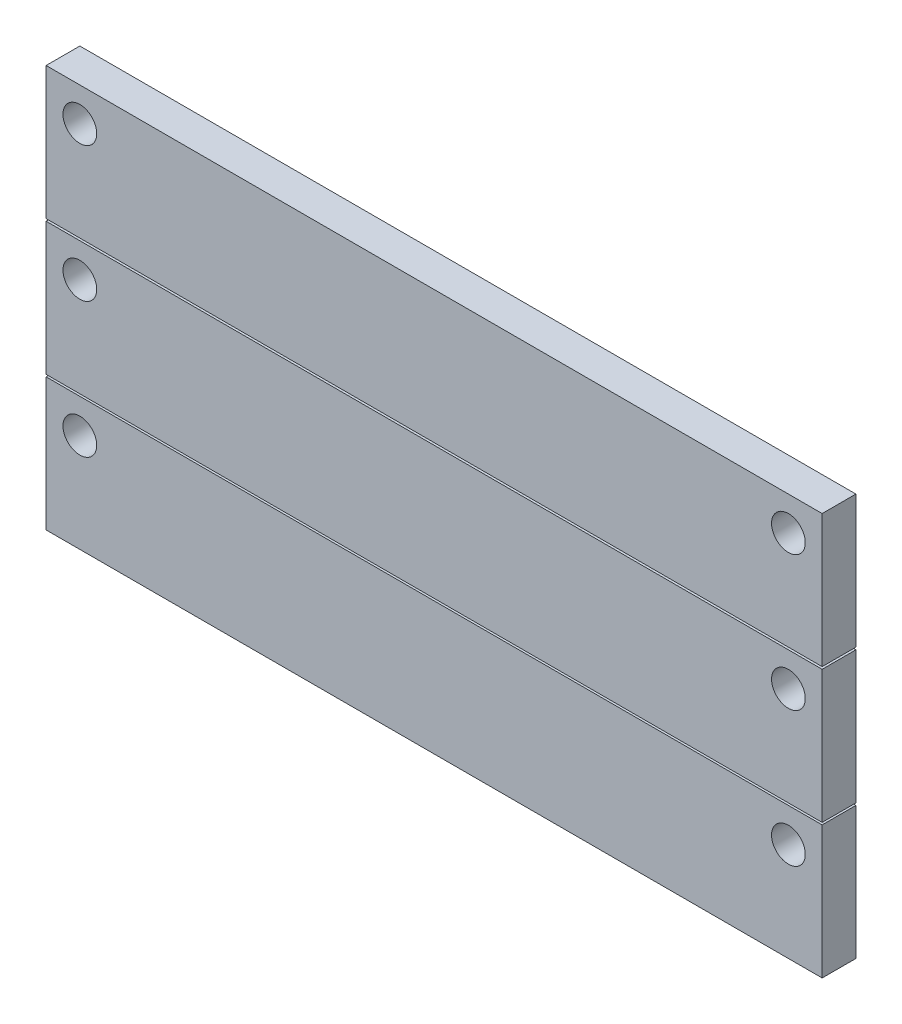
ISO-10303-21;
HEADER;
FILE_DESCRIPTION(('STEP AP214'),'2;1');
FILE_NAME('part.step','',(''),(''),'','','');
FILE_SCHEMA(('AUTOMOTIVE_DESIGN { 1 0 10303 214 1 1 1 1 }'));
ENDSEC;
DATA;
#1=APPLICATION_CONTEXT('core data for automotive mechanical design processes');
#2=APPLICATION_PROTOCOL_DEFINITION('international standard','automotive_design',2000,#1);
#3=PRODUCT_CONTEXT('',#1,'mechanical');
#4=PRODUCT('Part','Part','',(#3));
#5=PRODUCT_RELATED_PRODUCT_CATEGORY('part','',(#4));
#6=PRODUCT_DEFINITION_FORMATION('','',#4);
#7=PRODUCT_DEFINITION_CONTEXT('part definition',#1,'design');
#8=PRODUCT_DEFINITION('design','',#6,#7);
#9=PRODUCT_DEFINITION_SHAPE('','',#8);
#10=(LENGTH_UNIT() NAMED_UNIT(*) SI_UNIT(.MILLI.,.METRE.));
#11=(NAMED_UNIT(*) PLANE_ANGLE_UNIT() SI_UNIT($,.RADIAN.));
#12=(NAMED_UNIT(*) SI_UNIT($,.STERADIAN.) SOLID_ANGLE_UNIT());
#13=UNCERTAINTY_MEASURE_WITH_UNIT(LENGTH_MEASURE(1.E-05),#10,'distance_accuracy_value','');
#14=(GEOMETRIC_REPRESENTATION_CONTEXT(3) GLOBAL_UNCERTAINTY_ASSIGNED_CONTEXT((#13)) GLOBAL_UNIT_ASSIGNED_CONTEXT((#10,
#11,#12)) REPRESENTATION_CONTEXT('',''));
#15=CARTESIAN_POINT('',(0.,0.,0.));
#16=DIRECTION('',(0.,0.,1.));
#17=DIRECTION('',(1.,0.,0.));
#18=AXIS2_PLACEMENT_3D('',#15,#16,#17);
#19=CARTESIAN_POINT('',(0.,-201.267836193344,25.4));
#20=DIRECTION('',(0.,1.,0.));
#21=DIRECTION('',(0.,0.,1.));
#22=AXIS2_PLACEMENT_3D('',#19,#20,#21);
#23=PLANE('',#22);
#24=DIRECTION('',(1.,0.,0.));
#25=VECTOR('',#24,1.);
#26=CARTESIAN_POINT('',(0.,-201.267836193344,0.));
#27=LINE('',#26,#25);
#28=CARTESIAN_POINT('',(-584.2,-201.267836193344,0.));
#29=VERTEX_POINT('',#28);
#30=CARTESIAN_POINT('',(0.,-201.267836193344,0.));
#31=VERTEX_POINT('',#30);
#32=EDGE_CURVE('E114',#29,#31,#27,.T.);
#33=ORIENTED_EDGE('',*,*,#32,.T.);
#34=DIRECTION('',(0.,0.,-1.));
#35=VECTOR('',#34,1.);
#36=CARTESIAN_POINT('',(0.,-201.267836193344,25.4));
#37=LINE('',#36,#35);
#38=CARTESIAN_POINT('',(0.,-201.267836193344,25.4));
#39=VERTEX_POINT('',#38);
#40=EDGE_CURVE('E12',#39,#31,#37,.T.);
#41=ORIENTED_EDGE('',*,*,#40,.F.);
#42=DIRECTION('',(1.,0.,0.));
#43=VECTOR('',#42,1.);
#44=CARTESIAN_POINT('',(0.,-201.267836193344,25.4));
#45=LINE('',#44,#43);
#46=CARTESIAN_POINT('',(-584.2,-201.267836193344,25.4));
#47=VERTEX_POINT('',#46);
#48=EDGE_CURVE('E102',#47,#39,#45,.T.);
#49=ORIENTED_EDGE('',*,*,#48,.F.);
#50=DIRECTION('',(0.,0.,-1.));
#51=VECTOR('',#50,1.);
#52=CARTESIAN_POINT('',(-584.2,-201.267836193344,25.4));
#53=LINE('',#52,#51);
#54=EDGE_CURVE('E110',#47,#29,#53,.T.);
#55=ORIENTED_EDGE('',*,*,#54,.T.);
#56=EDGE_LOOP('',(#33,#41,#49,#55));
#57=FACE_BOUND('',#56,.T.);
#58=ADVANCED_FACE('F51',(#57),#23,.F.);
#59=CARTESIAN_POINT('',(0.,0.,25.4));
#60=DIRECTION('',(-1.,0.,0.));
#61=DIRECTION('',(0.,0.,1.));
#62=AXIS2_PLACEMENT_3D('',#59,#60,#61);
#63=PLANE('',#62);
#64=DIRECTION('',(0.,1.,0.));
#65=VECTOR('',#64,1.);
#66=CARTESIAN_POINT('',(0.,0.,0.));
#67=LINE('',#66,#65);
#68=CARTESIAN_POINT('',(0.,-101.445836193344,0.));
#69=VERTEX_POINT('',#68);
#70=EDGE_CURVE('E106',#31,#69,#67,.T.);
#71=ORIENTED_EDGE('',*,*,#70,.T.);
#72=DIRECTION('',(0.,0.,-1.));
#73=VECTOR('',#72,1.);
#74=CARTESIAN_POINT('',(0.,-101.445836193344,25.4));
#75=LINE('',#74,#73);
#76=CARTESIAN_POINT('',(0.,-101.445836193344,25.4));
#77=VERTEX_POINT('',#76);
#78=EDGE_CURVE('E59',#77,#69,#75,.T.);
#79=ORIENTED_EDGE('',*,*,#78,.F.);
#80=DIRECTION('',(0.,1.,0.));
#81=VECTOR('',#80,1.);
#82=CARTESIAN_POINT('',(0.,0.,25.4));
#83=LINE('',#82,#81);
#84=EDGE_CURVE('E97',#39,#77,#83,.T.);
#85=ORIENTED_EDGE('',*,*,#84,.F.);
#86=ORIENTED_EDGE('',*,*,#40,.T.);
#87=EDGE_LOOP('',(#71,#79,#85,#86));
#88=FACE_BOUND('',#87,.T.);
#89=ADVANCED_FACE('F105',(#88),#63,.F.);
#90=CARTESIAN_POINT('',(0.,-101.445836193344,25.4));
#91=DIRECTION('',(0.,-1.,0.));
#92=DIRECTION('',(1.,0.,0.));
#93=AXIS2_PLACEMENT_3D('',#90,#91,#92);
#94=PLANE('',#93);
#95=DIRECTION('',(-1.,0.,0.));
#96=VECTOR('',#95,1.);
#97=CARTESIAN_POINT('',(0.,-101.445836193344,0.));
#98=LINE('',#97,#96);
#99=CARTESIAN_POINT('',(-584.2,-101.445836193344,0.));
#100=VERTEX_POINT('',#99);
#101=EDGE_CURVE('E84',#69,#100,#98,.T.);
#102=ORIENTED_EDGE('',*,*,#101,.T.);
#103=DIRECTION('',(0.,0.,-1.));
#104=VECTOR('',#103,1.);
#105=CARTESIAN_POINT('',(-584.2,-101.445836193344,25.4));
#106=LINE('',#105,#104);
#107=CARTESIAN_POINT('',(-584.2,-101.445836193344,25.4));
#108=VERTEX_POINT('',#107);
#109=EDGE_CURVE('E107',#108,#100,#106,.T.);
#110=ORIENTED_EDGE('',*,*,#109,.F.);
#111=DIRECTION('',(-1.,0.,0.));
#112=VECTOR('',#111,1.);
#113=CARTESIAN_POINT('',(0.,-101.445836193344,25.4));
#114=LINE('',#113,#112);
#115=EDGE_CURVE('E100',#77,#108,#114,.T.);
#116=ORIENTED_EDGE('',*,*,#115,.F.);
#117=ORIENTED_EDGE('',*,*,#78,.T.);
#118=EDGE_LOOP('',(#102,#110,#116,#117));
#119=FACE_BOUND('',#118,.T.);
#120=ADVANCED_FACE('F108',(#119),#94,.F.);
#121=CARTESIAN_POINT('',(-584.199999999999,1.94924653178462E-12,25.4));
#122=DIRECTION('',(1.,0.,0.));
#123=DIRECTION('',(0.,1.,0.));
#124=AXIS2_PLACEMENT_3D('',#121,#122,#123);
#125=PLANE('',#124);
#126=DIRECTION('',(0.,-1.,0.));
#127=VECTOR('',#126,1.);
#128=CARTESIAN_POINT('',(-584.199999999999,1.94924653178462E-12,0.));
#129=LINE('',#128,#127);
#130=EDGE_CURVE('E90',#100,#29,#129,.T.);
#131=ORIENTED_EDGE('',*,*,#130,.T.);
#132=ORIENTED_EDGE('',*,*,#54,.F.);
#133=DIRECTION('',(0.,-1.,0.));
#134=VECTOR('',#133,1.);
#135=CARTESIAN_POINT('',(-584.199999999999,1.94924653178462E-12,25.4));
#136=LINE('',#135,#134);
#137=EDGE_CURVE('E67',#108,#47,#136,.T.);
#138=ORIENTED_EDGE('',*,*,#137,.F.);
#139=ORIENTED_EDGE('',*,*,#109,.T.);
#140=EDGE_LOOP('',(#131,#132,#138,#139));
#141=FACE_BOUND('',#140,.T.);
#142=ADVANCED_FACE('F122',(#141),#125,.F.);
#143=CARTESIAN_POINT('',(0.,0.,25.4));
#144=DIRECTION('',(0.,0.,1.));
#145=DIRECTION('',(1.,0.,0.));
#146=AXIS2_PLACEMENT_3D('',#143,#144,#145);
#147=PLANE('',#146);
#148=CARTESIAN_POINT('',(-25.4000000000007,-127.06030892801,25.4));
#149=DIRECTION('',(0.,0.,1.));
#150=DIRECTION('',(-1.,0.,0.));
#151=AXIS2_PLACEMENT_3D('',#148,#149,#150);
#152=CIRCLE('',#151,12.7);
#153=CARTESIAN_POINT('',(-38.1000000000006,-127.06030892801,25.4));
#154=VERTEX_POINT('',#153);
#155=EDGE_CURVE('E134',#154,#154,#152,.T.);
#156=ORIENTED_EDGE('',*,*,#155,.F.);
#157=EDGE_LOOP('',(#156));
#158=FACE_BOUND('',#157,.T.);
#159=CARTESIAN_POINT('',(-558.8,-127.06030892801,25.4));
#160=DIRECTION('',(0.,0.,1.));
#161=DIRECTION('',(1.,0.,0.));
#162=AXIS2_PLACEMENT_3D('',#159,#160,#161);
#163=CIRCLE('',#162,12.7);
#164=CARTESIAN_POINT('',(-546.1,-127.06030892801,25.4));
#165=VERTEX_POINT('',#164);
#166=EDGE_CURVE('E128',#165,#165,#163,.T.);
#167=ORIENTED_EDGE('',*,*,#166,.F.);
#168=EDGE_LOOP('',(#167));
#169=FACE_BOUND('',#168,.T.);
#170=ORIENTED_EDGE('',*,*,#48,.T.);
#171=ORIENTED_EDGE('',*,*,#84,.T.);
#172=ORIENTED_EDGE('',*,*,#115,.T.);
#173=ORIENTED_EDGE('',*,*,#137,.T.);
#174=EDGE_LOOP('',(#170,#171,#172,#173));
#175=FACE_BOUND('',#174,.T.);
#176=ADVANCED_FACE('F98',(#158,#169,#175),#147,.T.);
#177=CARTESIAN_POINT('',(0.,0.,0.));
#178=DIRECTION('',(0.,0.,1.));
#179=DIRECTION('',(1.,0.,0.));
#180=AXIS2_PLACEMENT_3D('',#177,#178,#179);
#181=PLANE('',#180);
#182=CARTESIAN_POINT('',(-25.4000000000007,-127.06030892801,0.));
#183=DIRECTION('',(0.,0.,1.));
#184=DIRECTION('',(-1.,0.,0.));
#185=AXIS2_PLACEMENT_3D('',#182,#183,#184);
#186=CIRCLE('',#185,12.7);
#187=CARTESIAN_POINT('',(-38.1000000000006,-127.06030892801,0.));
#188=VERTEX_POINT('',#187);
#189=EDGE_CURVE('E131',#188,#188,#186,.T.);
#190=ORIENTED_EDGE('',*,*,#189,.T.);
#191=EDGE_LOOP('',(#190));
#192=FACE_BOUND('',#191,.T.);
#193=CARTESIAN_POINT('',(-558.8,-127.06030892801,0.));
#194=DIRECTION('',(0.,0.,1.));
#195=DIRECTION('',(1.,0.,0.));
#196=AXIS2_PLACEMENT_3D('',#193,#194,#195);
#197=CIRCLE('',#196,12.7);
#198=CARTESIAN_POINT('',(-546.1,-127.06030892801,0.));
#199=VERTEX_POINT('',#198);
#200=EDGE_CURVE('E117',#199,#199,#197,.T.);
#201=ORIENTED_EDGE('',*,*,#200,.T.);
#202=EDGE_LOOP('',(#201));
#203=FACE_BOUND('',#202,.T.);
#204=ORIENTED_EDGE('',*,*,#32,.F.);
#205=ORIENTED_EDGE('',*,*,#130,.F.);
#206=ORIENTED_EDGE('',*,*,#101,.F.);
#207=ORIENTED_EDGE('',*,*,#70,.F.);
#208=EDGE_LOOP('',(#204,#205,#206,#207));
#209=FACE_BOUND('',#208,.T.);
#210=ADVANCED_FACE('F125',(#192,#203,#209),#181,.F.);
#211=CARTESIAN_POINT('',(-558.8,-127.06030892801,0.));
#212=DIRECTION('',(0.,0.,1.));
#213=DIRECTION('',(1.,0.,0.));
#214=AXIS2_PLACEMENT_3D('',#211,#212,#213);
#215=CYLINDRICAL_SURFACE('',#214,12.7);
#216=ORIENTED_EDGE('',*,*,#200,.F.);
#217=EDGE_LOOP('',(#216));
#218=FACE_BOUND('',#217,.T.);
#219=ORIENTED_EDGE('',*,*,#166,.T.);
#220=EDGE_LOOP('',(#219));
#221=FACE_BOUND('',#220,.T.);
#222=ADVANCED_FACE('F145',(#218,#221),#215,.F.);
#223=CARTESIAN_POINT('',(-25.4000000000007,-127.06030892801,0.));
#224=DIRECTION('',(0.,0.,1.));
#225=DIRECTION('',(1.,0.,0.));
#226=AXIS2_PLACEMENT_3D('',#223,#224,#225);
#227=CYLINDRICAL_SURFACE('',#226,12.7);
#228=ORIENTED_EDGE('',*,*,#189,.F.);
#229=EDGE_LOOP('',(#228));
#230=FACE_BOUND('',#229,.T.);
#231=ORIENTED_EDGE('',*,*,#155,.T.);
#232=EDGE_LOOP('',(#231));
#233=FACE_BOUND('',#232,.T.);
#234=ADVANCED_FACE('F142',(#230,#233),#227,.F.);
#235=CLOSED_SHELL('',(#58,#89,#120,#142,#176,#210,#222,#234));
#236=MANIFOLD_SOLID_BREP('B2',#235);
#237=CARTESIAN_POINT('',(0.,-99.822,25.4));
#238=DIRECTION('',(0.,1.,0.));
#239=DIRECTION('',(0.,0.,1.));
#240=AXIS2_PLACEMENT_3D('',#237,#238,#239);
#241=PLANE('',#240);
#242=DIRECTION('',(1.,0.,0.));
#243=VECTOR('',#242,1.);
#244=CARTESIAN_POINT('',(0.,-99.822,0.));
#245=LINE('',#244,#243);
#246=CARTESIAN_POINT('',(-584.2,-99.822,0.));
#247=VERTEX_POINT('',#246);
#248=CARTESIAN_POINT('',(0.,-99.822,0.));
#249=VERTEX_POINT('',#248);
#250=EDGE_CURVE('E288',#247,#249,#245,.T.);
#251=ORIENTED_EDGE('',*,*,#250,.T.);
#252=DIRECTION('',(0.,0.,-1.));
#253=VECTOR('',#252,1.);
#254=CARTESIAN_POINT('',(0.,-99.822,25.4));
#255=LINE('',#254,#253);
#256=CARTESIAN_POINT('',(0.,-99.822,25.4));
#257=VERTEX_POINT('',#256);
#258=EDGE_CURVE('E49',#257,#249,#255,.T.);
#259=ORIENTED_EDGE('',*,*,#258,.F.);
#260=DIRECTION('',(1.,0.,0.));
#261=VECTOR('',#260,1.);
#262=CARTESIAN_POINT('',(0.,-99.822,25.4));
#263=LINE('',#262,#261);
#264=CARTESIAN_POINT('',(-584.2,-99.822,25.4));
#265=VERTEX_POINT('',#264);
#266=EDGE_CURVE('E276',#265,#257,#263,.T.);
#267=ORIENTED_EDGE('',*,*,#266,.F.);
#268=DIRECTION('',(0.,0.,-1.));
#269=VECTOR('',#268,1.);
#270=CARTESIAN_POINT('',(-584.2,-99.822,25.4));
#271=LINE('',#270,#269);
#272=EDGE_CURVE('E284',#265,#247,#271,.T.);
#273=ORIENTED_EDGE('',*,*,#272,.T.);
#274=EDGE_LOOP('',(#251,#259,#267,#273));
#275=FACE_BOUND('',#274,.T.);
#276=ADVANCED_FACE('F225',(#275),#241,.F.);
#277=CARTESIAN_POINT('',(0.,0.,25.4));
#278=DIRECTION('',(-1.,0.,0.));
#279=DIRECTION('',(0.,0.,1.));
#280=AXIS2_PLACEMENT_3D('',#277,#278,#279);
#281=PLANE('',#280);
#282=DIRECTION('',(0.,1.,0.));
#283=VECTOR('',#282,1.);
#284=CARTESIAN_POINT('',(0.,0.,0.));
#285=LINE('',#284,#283);
#286=CARTESIAN_POINT('',(0.,0.,0.));
#287=VERTEX_POINT('',#286);
#288=EDGE_CURVE('E280',#249,#287,#285,.T.);
#289=ORIENTED_EDGE('',*,*,#288,.T.);
#290=DIRECTION('',(0.,0.,-1.));
#291=VECTOR('',#290,1.);
#292=CARTESIAN_POINT('',(0.,0.,25.4));
#293=LINE('',#292,#291);
#294=CARTESIAN_POINT('',(0.,0.,25.4));
#295=VERTEX_POINT('',#294);
#296=EDGE_CURVE('E233',#295,#287,#293,.T.);
#297=ORIENTED_EDGE('',*,*,#296,.F.);
#298=DIRECTION('',(0.,1.,0.));
#299=VECTOR('',#298,1.);
#300=CARTESIAN_POINT('',(0.,0.,25.4));
#301=LINE('',#300,#299);
#302=EDGE_CURVE('E271',#257,#295,#301,.T.);
#303=ORIENTED_EDGE('',*,*,#302,.F.);
#304=ORIENTED_EDGE('',*,*,#258,.T.);
#305=EDGE_LOOP('',(#289,#297,#303,#304));
#306=FACE_BOUND('',#305,.T.);
#307=ADVANCED_FACE('F279',(#306),#281,.F.);
#308=CARTESIAN_POINT('',(0.,0.,25.4));
#309=DIRECTION('',(0.,-1.,0.));
#310=DIRECTION('',(1.,0.,0.));
#311=AXIS2_PLACEMENT_3D('',#308,#309,#310);
#312=PLANE('',#311);
#313=DIRECTION('',(-1.,0.,0.));
#314=VECTOR('',#313,1.);
#315=CARTESIAN_POINT('',(0.,0.,0.));
#316=LINE('',#315,#314);
#317=CARTESIAN_POINT('',(-584.2,0.,0.));
#318=VERTEX_POINT('',#317);
#319=EDGE_CURVE('E258',#287,#318,#316,.T.);
#320=ORIENTED_EDGE('',*,*,#319,.T.);
#321=DIRECTION('',(0.,0.,-1.));
#322=VECTOR('',#321,1.);
#323=CARTESIAN_POINT('',(-584.2,0.,25.4));
#324=LINE('',#323,#322);
#325=CARTESIAN_POINT('',(-584.2,0.,25.4));
#326=VERTEX_POINT('',#325);
#327=EDGE_CURVE('E281',#326,#318,#324,.T.);
#328=ORIENTED_EDGE('',*,*,#327,.F.);
#329=DIRECTION('',(-1.,0.,0.));
#330=VECTOR('',#329,1.);
#331=CARTESIAN_POINT('',(0.,0.,25.4));
#332=LINE('',#331,#330);
#333=EDGE_CURVE('E274',#295,#326,#332,.T.);
#334=ORIENTED_EDGE('',*,*,#333,.F.);
#335=ORIENTED_EDGE('',*,*,#296,.T.);
#336=EDGE_LOOP('',(#320,#328,#334,#335));
#337=FACE_BOUND('',#336,.T.);
#338=ADVANCED_FACE('F282',(#337),#312,.F.);
#339=CARTESIAN_POINT('',(-584.2,1.94924653178463E-12,25.4));
#340=DIRECTION('',(1.,0.,0.));
#341=DIRECTION('',(0.,1.,0.));
#342=AXIS2_PLACEMENT_3D('',#339,#340,#341);
#343=PLANE('',#342);
#344=DIRECTION('',(0.,-1.,0.));
#345=VECTOR('',#344,1.);
#346=CARTESIAN_POINT('',(-584.2,1.94924653178463E-12,0.));
#347=LINE('',#346,#345);
#348=EDGE_CURVE('E264',#318,#247,#347,.T.);
#349=ORIENTED_EDGE('',*,*,#348,.T.);
#350=ORIENTED_EDGE('',*,*,#272,.F.);
#351=DIRECTION('',(0.,-1.,0.));
#352=VECTOR('',#351,1.);
#353=CARTESIAN_POINT('',(-584.2,1.94924653178463E-12,25.4));
#354=LINE('',#353,#352);
#355=EDGE_CURVE('E241',#326,#265,#354,.T.);
#356=ORIENTED_EDGE('',*,*,#355,.F.);
#357=ORIENTED_EDGE('',*,*,#327,.T.);
#358=EDGE_LOOP('',(#349,#350,#356,#357));
#359=FACE_BOUND('',#358,.T.);
#360=ADVANCED_FACE('F296',(#359),#343,.F.);
#361=CARTESIAN_POINT('',(0.,0.,25.4));
#362=DIRECTION('',(0.,0.,1.));
#363=DIRECTION('',(1.,0.,0.));
#364=AXIS2_PLACEMENT_3D('',#361,#362,#363);
#365=PLANE('',#364);
#366=CARTESIAN_POINT('',(-25.4000000000003,-25.4603089280097,25.4));
#367=DIRECTION('',(0.,0.,1.));
#368=DIRECTION('',(-1.,0.,0.));
#369=AXIS2_PLACEMENT_3D('',#366,#367,#368);
#370=CIRCLE('',#369,12.7);
#371=CARTESIAN_POINT('',(-38.1000000000003,-25.4603089280097,25.4));
#372=VERTEX_POINT('',#371);
#373=EDGE_CURVE('E308',#372,#372,#370,.T.);
#374=ORIENTED_EDGE('',*,*,#373,.F.);
#375=EDGE_LOOP('',(#374));
#376=FACE_BOUND('',#375,.T.);
#377=CARTESIAN_POINT('',(-558.8,-25.4603089280097,25.4));
#378=DIRECTION('',(0.,0.,1.));
#379=DIRECTION('',(1.,0.,0.));
#380=AXIS2_PLACEMENT_3D('',#377,#378,#379);
#381=CIRCLE('',#380,12.7);
#382=CARTESIAN_POINT('',(-546.1,-25.4603089280097,25.4));
#383=VERTEX_POINT('',#382);
#384=EDGE_CURVE('E302',#383,#383,#381,.T.);
#385=ORIENTED_EDGE('',*,*,#384,.F.);
#386=EDGE_LOOP('',(#385));
#387=FACE_BOUND('',#386,.T.);
#388=ORIENTED_EDGE('',*,*,#266,.T.);
#389=ORIENTED_EDGE('',*,*,#302,.T.);
#390=ORIENTED_EDGE('',*,*,#333,.T.);
#391=ORIENTED_EDGE('',*,*,#355,.T.);
#392=EDGE_LOOP('',(#388,#389,#390,#391));
#393=FACE_BOUND('',#392,.T.);
#394=ADVANCED_FACE('F272',(#376,#387,#393),#365,.T.);
#395=CARTESIAN_POINT('',(0.,0.,0.));
#396=DIRECTION('',(0.,0.,1.));
#397=DIRECTION('',(1.,0.,0.));
#398=AXIS2_PLACEMENT_3D('',#395,#396,#397);
#399=PLANE('',#398);
#400=CARTESIAN_POINT('',(-25.4000000000003,-25.4603089280097,0.));
#401=DIRECTION('',(0.,0.,1.));
#402=DIRECTION('',(-1.,0.,0.));
#403=AXIS2_PLACEMENT_3D('',#400,#401,#402);
#404=CIRCLE('',#403,12.7);
#405=CARTESIAN_POINT('',(-38.1000000000003,-25.4603089280097,0.));
#406=VERTEX_POINT('',#405);
#407=EDGE_CURVE('E305',#406,#406,#404,.T.);
#408=ORIENTED_EDGE('',*,*,#407,.T.);
#409=EDGE_LOOP('',(#408));
#410=FACE_BOUND('',#409,.T.);
#411=CARTESIAN_POINT('',(-558.8,-25.4603089280097,0.));
#412=DIRECTION('',(0.,0.,1.));
#413=DIRECTION('',(1.,0.,0.));
#414=AXIS2_PLACEMENT_3D('',#411,#412,#413);
#415=CIRCLE('',#414,12.7);
#416=CARTESIAN_POINT('',(-546.1,-25.4603089280097,0.));
#417=VERTEX_POINT('',#416);
#418=EDGE_CURVE('E291',#417,#417,#415,.T.);
#419=ORIENTED_EDGE('',*,*,#418,.T.);
#420=EDGE_LOOP('',(#419));
#421=FACE_BOUND('',#420,.T.);
#422=ORIENTED_EDGE('',*,*,#250,.F.);
#423=ORIENTED_EDGE('',*,*,#348,.F.);
#424=ORIENTED_EDGE('',*,*,#319,.F.);
#425=ORIENTED_EDGE('',*,*,#288,.F.);
#426=EDGE_LOOP('',(#422,#423,#424,#425));
#427=FACE_BOUND('',#426,.T.);
#428=ADVANCED_FACE('F299',(#410,#421,#427),#399,.F.);
#429=CARTESIAN_POINT('',(-558.8,-25.4603089280097,0.));
#430=DIRECTION('',(0.,0.,1.));
#431=DIRECTION('',(1.,0.,0.));
#432=AXIS2_PLACEMENT_3D('',#429,#430,#431);
#433=CYLINDRICAL_SURFACE('',#432,12.7);
#434=ORIENTED_EDGE('',*,*,#418,.F.);
#435=EDGE_LOOP('',(#434));
#436=FACE_BOUND('',#435,.T.);
#437=ORIENTED_EDGE('',*,*,#384,.T.);
#438=EDGE_LOOP('',(#437));
#439=FACE_BOUND('',#438,.T.);
#440=ADVANCED_FACE('F319',(#436,#439),#433,.F.);
#441=CARTESIAN_POINT('',(-25.4000000000003,-25.4603089280097,0.));
#442=DIRECTION('',(0.,0.,1.));
#443=DIRECTION('',(1.,0.,0.));
#444=AXIS2_PLACEMENT_3D('',#441,#442,#443);
#445=CYLINDRICAL_SURFACE('',#444,12.7);
#446=ORIENTED_EDGE('',*,*,#407,.F.);
#447=EDGE_LOOP('',(#446));
#448=FACE_BOUND('',#447,.T.);
#449=ORIENTED_EDGE('',*,*,#373,.T.);
#450=EDGE_LOOP('',(#449));
#451=FACE_BOUND('',#450,.T.);
#452=ADVANCED_FACE('F316',(#448,#451),#445,.F.);
#453=CLOSED_SHELL('',(#276,#307,#338,#360,#394,#428,#440,#452));
#454=MANIFOLD_SOLID_BREP('B6',#453);
#455=CARTESIAN_POINT('',(0.,1.71769107199028,25.4));
#456=DIRECTION('',(0.,1.,0.));
#457=DIRECTION('',(0.,0.,1.));
#458=AXIS2_PLACEMENT_3D('',#455,#456,#457);
#459=PLANE('',#458);
#460=DIRECTION('',(1.,0.,0.));
#461=VECTOR('',#460,1.);
#462=CARTESIAN_POINT('',(0.,1.71769107199028,0.));
#463=LINE('',#462,#461);
#464=CARTESIAN_POINT('',(-584.2,1.71769107199028,0.));
#465=VERTEX_POINT('',#464);
#466=CARTESIAN_POINT('',(0.,1.71769107199028,0.));
#467=VERTEX_POINT('',#466);
#468=EDGE_CURVE('E458',#465,#467,#463,.T.);
#469=ORIENTED_EDGE('',*,*,#468,.T.);
#470=DIRECTION('',(0.,0.,-1.));
#471=VECTOR('',#470,1.);
#472=CARTESIAN_POINT('',(0.,1.71769107199028,25.4));
#473=LINE('',#472,#471);
#474=CARTESIAN_POINT('',(0.,1.71769107199028,25.4));
#475=VERTEX_POINT('',#474);
#476=EDGE_CURVE('E223',#475,#467,#473,.T.);
#477=ORIENTED_EDGE('',*,*,#476,.F.);
#478=DIRECTION('',(1.,0.,0.));
#479=VECTOR('',#478,1.);
#480=CARTESIAN_POINT('',(0.,1.71769107199028,25.4));
#481=LINE('',#480,#479);
#482=CARTESIAN_POINT('',(-584.2,1.71769107199028,25.4));
#483=VERTEX_POINT('',#482);
#484=EDGE_CURVE('E442',#483,#475,#481,.T.);
#485=ORIENTED_EDGE('',*,*,#484,.F.);
#486=DIRECTION('',(0.,0.,-1.));
#487=VECTOR('',#486,1.);
#488=CARTESIAN_POINT('',(-584.2,1.71769107199028,25.4));
#489=LINE('',#488,#487);
#490=EDGE_CURVE('E454',#483,#465,#489,.T.);
#491=ORIENTED_EDGE('',*,*,#490,.T.);
#492=EDGE_LOOP('',(#469,#477,#485,#491));
#493=FACE_BOUND('',#492,.T.);
#494=ADVANCED_FACE('F390',(#493),#459,.F.);
#495=CARTESIAN_POINT('',(0.,0.,25.4));
#496=DIRECTION('',(-1.,0.,0.));
#497=DIRECTION('',(0.,0.,1.));
#498=AXIS2_PLACEMENT_3D('',#495,#496,#497);
#499=PLANE('',#498);
#500=DIRECTION('',(0.,1.,0.));
#501=VECTOR('',#500,1.);
#502=CARTESIAN_POINT('',(0.,0.,0.));
#503=LINE('',#502,#501);
#504=CARTESIAN_POINT('',(0.,101.53969107199,0.));
#505=VERTEX_POINT('',#504);
#506=EDGE_CURVE('E447',#467,#505,#503,.T.);
#507=ORIENTED_EDGE('',*,*,#506,.T.);
#508=DIRECTION('',(0.,0.,-1.));
#509=VECTOR('',#508,1.);
#510=CARTESIAN_POINT('',(0.,101.53969107199,25.4));
#511=LINE('',#510,#509);
#512=CARTESIAN_POINT('',(0.,101.53969107199,25.4));
#513=VERTEX_POINT('',#512);
#514=EDGE_CURVE('E399',#513,#505,#511,.T.);
#515=ORIENTED_EDGE('',*,*,#514,.F.);
#516=DIRECTION('',(0.,1.,0.));
#517=VECTOR('',#516,1.);
#518=CARTESIAN_POINT('',(0.,0.,25.4));
#519=LINE('',#518,#517);
#520=EDGE_CURVE('E437',#475,#513,#519,.T.);
#521=ORIENTED_EDGE('',*,*,#520,.F.);
#522=ORIENTED_EDGE('',*,*,#476,.T.);
#523=EDGE_LOOP('',(#507,#515,#521,#522));
#524=FACE_BOUND('',#523,.T.);
#525=ADVANCED_FACE('F446',(#524),#499,.F.);
#526=CARTESIAN_POINT('',(0.,101.53969107199,25.4));
#527=DIRECTION('',(0.,-1.,0.));
#528=DIRECTION('',(1.,0.,0.));
#529=AXIS2_PLACEMENT_3D('',#526,#527,#528);
#530=PLANE('',#529);
#531=DIRECTION('',(-1.,0.,0.));
#532=VECTOR('',#531,1.);
#533=CARTESIAN_POINT('',(0.,101.53969107199,0.));
#534=LINE('',#533,#532);
#535=CARTESIAN_POINT('',(-584.2,101.53969107199,0.));
#536=VERTEX_POINT('',#535);
#537=EDGE_CURVE('E424',#505,#536,#534,.T.);
#538=ORIENTED_EDGE('',*,*,#537,.T.);
#539=DIRECTION('',(0.,0.,-1.));
#540=VECTOR('',#539,1.);
#541=CARTESIAN_POINT('',(-584.2,101.53969107199,25.4));
#542=LINE('',#541,#540);
#543=CARTESIAN_POINT('',(-584.2,101.53969107199,25.4));
#544=VERTEX_POINT('',#543);
#545=EDGE_CURVE('E449',#544,#536,#542,.T.);
#546=ORIENTED_EDGE('',*,*,#545,.F.);
#547=DIRECTION('',(-1.,0.,0.));
#548=VECTOR('',#547,1.);
#549=CARTESIAN_POINT('',(0.,101.53969107199,25.4));
#550=LINE('',#549,#548);
#551=EDGE_CURVE('E440',#513,#544,#550,.T.);
#552=ORIENTED_EDGE('',*,*,#551,.F.);
#553=ORIENTED_EDGE('',*,*,#514,.T.);
#554=EDGE_LOOP('',(#538,#546,#552,#553));
#555=FACE_BOUND('',#554,.T.);
#556=ADVANCED_FACE('F450',(#555),#530,.F.);
#557=CARTESIAN_POINT('',(-584.2,1.94924653178463E-12,25.4));
#558=DIRECTION('',(1.,0.,0.));
#559=DIRECTION('',(0.,1.,0.));
#560=AXIS2_PLACEMENT_3D('',#557,#558,#559);
#561=PLANE('',#560);
#562=DIRECTION('',(0.,-1.,0.));
#563=VECTOR('',#562,1.);
#564=CARTESIAN_POINT('',(-584.2,1.94924653178463E-12,0.));
#565=LINE('',#564,#563);
#566=EDGE_CURVE('E430',#536,#465,#565,.T.);
#567=ORIENTED_EDGE('',*,*,#566,.T.);
#568=ORIENTED_EDGE('',*,*,#490,.F.);
#569=DIRECTION('',(0.,-1.,0.));
#570=VECTOR('',#569,1.);
#571=CARTESIAN_POINT('',(-584.2,1.94924653178463E-12,25.4));
#572=LINE('',#571,#570);
#573=EDGE_CURVE('E407',#544,#483,#572,.T.);
#574=ORIENTED_EDGE('',*,*,#573,.F.);
#575=ORIENTED_EDGE('',*,*,#545,.T.);
#576=EDGE_LOOP('',(#567,#568,#574,#575));
#577=FACE_BOUND('',#576,.T.);
#578=ADVANCED_FACE('F472',(#577),#561,.F.);
#579=CARTESIAN_POINT('',(0.,0.,25.4));
#580=DIRECTION('',(0.,0.,1.));
#581=DIRECTION('',(1.,0.,0.));
#582=AXIS2_PLACEMENT_3D('',#579,#580,#581);
#583=PLANE('',#582);
#584=CARTESIAN_POINT('',(-558.8,76.1396910719903,25.4));
#585=DIRECTION('',(0.,0.,1.));
#586=DIRECTION('',(1.,0.,0.));
#587=AXIS2_PLACEMENT_3D('',#584,#585,#586);
#588=CIRCLE('',#587,12.7);
#589=CARTESIAN_POINT('',(-546.1,76.1396910719903,25.4));
#590=VERTEX_POINT('',#589);
#591=EDGE_CURVE('E487',#590,#590,#588,.T.);
#592=ORIENTED_EDGE('',*,*,#591,.F.);
#593=EDGE_LOOP('',(#592));
#594=FACE_BOUND('',#593,.T.);
#595=CARTESIAN_POINT('',(-25.4,76.1396910719903,25.4));
#596=DIRECTION('',(0.,0.,1.));
#597=DIRECTION('',(-1.,0.,0.));
#598=AXIS2_PLACEMENT_3D('',#595,#596,#597);
#599=CIRCLE('',#598,12.7);
#600=CARTESIAN_POINT('',(-38.1,76.1396910719903,25.4));
#601=VERTEX_POINT('',#600);
#602=EDGE_CURVE('E479',#601,#601,#599,.T.);
#603=ORIENTED_EDGE('',*,*,#602,.F.);
#604=EDGE_LOOP('',(#603));
#605=FACE_BOUND('',#604,.T.);
#606=ORIENTED_EDGE('',*,*,#484,.T.);
#607=ORIENTED_EDGE('',*,*,#520,.T.);
#608=ORIENTED_EDGE('',*,*,#551,.T.);
#609=ORIENTED_EDGE('',*,*,#573,.T.);
#610=EDGE_LOOP('',(#606,#607,#608,#609));
#611=FACE_BOUND('',#610,.T.);
#612=ADVANCED_FACE('F438',(#594,#605,#611),#583,.T.);
#613=CARTESIAN_POINT('',(0.,0.,0.));
#614=DIRECTION('',(0.,0.,1.));
#615=DIRECTION('',(1.,0.,0.));
#616=AXIS2_PLACEMENT_3D('',#613,#614,#615);
#617=PLANE('',#616);
#618=CARTESIAN_POINT('',(-558.8,76.1396910719903,0.));
#619=DIRECTION('',(0.,0.,1.));
#620=DIRECTION('',(1.,0.,0.));
#621=AXIS2_PLACEMENT_3D('',#618,#619,#620);
#622=CIRCLE('',#621,12.7);
#623=CARTESIAN_POINT('',(-546.1,76.1396910719903,0.));
#624=VERTEX_POINT('',#623);
#625=EDGE_CURVE('E462',#624,#624,#622,.T.);
#626=ORIENTED_EDGE('',*,*,#625,.T.);
#627=EDGE_LOOP('',(#626));
#628=FACE_BOUND('',#627,.T.);
#629=CARTESIAN_POINT('',(-25.4,76.1396910719903,0.));
#630=DIRECTION('',(0.,0.,1.));
#631=DIRECTION('',(-1.,0.,0.));
#632=AXIS2_PLACEMENT_3D('',#629,#630,#631);
#633=CIRCLE('',#632,12.7);
#634=CARTESIAN_POINT('',(-38.1,76.1396910719903,0.));
#635=VERTEX_POINT('',#634);
#636=EDGE_CURVE('E483',#635,#635,#633,.T.);
#637=ORIENTED_EDGE('',*,*,#636,.T.);
#638=EDGE_LOOP('',(#637));
#639=FACE_BOUND('',#638,.T.);
#640=ORIENTED_EDGE('',*,*,#468,.F.);
#641=ORIENTED_EDGE('',*,*,#566,.F.);
#642=ORIENTED_EDGE('',*,*,#537,.F.);
#643=ORIENTED_EDGE('',*,*,#506,.F.);
#644=EDGE_LOOP('',(#640,#641,#642,#643));
#645=FACE_BOUND('',#644,.T.);
#646=ADVANCED_FACE('F475',(#628,#639,#645),#617,.F.);
#647=CARTESIAN_POINT('',(-25.4,76.1396910719903,0.));
#648=DIRECTION('',(0.,0.,1.));
#649=DIRECTION('',(1.,0.,0.));
#650=AXIS2_PLACEMENT_3D('',#647,#648,#649);
#651=CYLINDRICAL_SURFACE('',#650,12.7);
#652=ORIENTED_EDGE('',*,*,#636,.F.);
#653=EDGE_LOOP('',(#652));
#654=FACE_BOUND('',#653,.T.);
#655=ORIENTED_EDGE('',*,*,#602,.T.);
#656=EDGE_LOOP('',(#655));
#657=FACE_BOUND('',#656,.T.);
#658=ADVANCED_FACE('F500',(#654,#657),#651,.F.);
#659=CARTESIAN_POINT('',(-558.8,76.1396910719903,0.));
#660=DIRECTION('',(0.,0.,1.));
#661=DIRECTION('',(1.,0.,0.));
#662=AXIS2_PLACEMENT_3D('',#659,#660,#661);
#663=CYLINDRICAL_SURFACE('',#662,12.7);
#664=ORIENTED_EDGE('',*,*,#625,.F.);
#665=EDGE_LOOP('',(#664));
#666=FACE_BOUND('',#665,.T.);
#667=ORIENTED_EDGE('',*,*,#591,.T.);
#668=EDGE_LOOP('',(#667));
#669=FACE_BOUND('',#668,.T.);
#670=ADVANCED_FACE('F497',(#666,#669),#663,.F.);
#671=CLOSED_SHELL('',(#494,#525,#556,#578,#612,#646,#658,#670));
#672=MANIFOLD_SOLID_BREP('B43',#671);
#673=ADVANCED_BREP_SHAPE_REPRESENTATION('',(#18,#236,#454,#672),#14);
#674=SHAPE_DEFINITION_REPRESENTATION(#9,#673);
ENDSEC;
END-ISO-10303-21;
